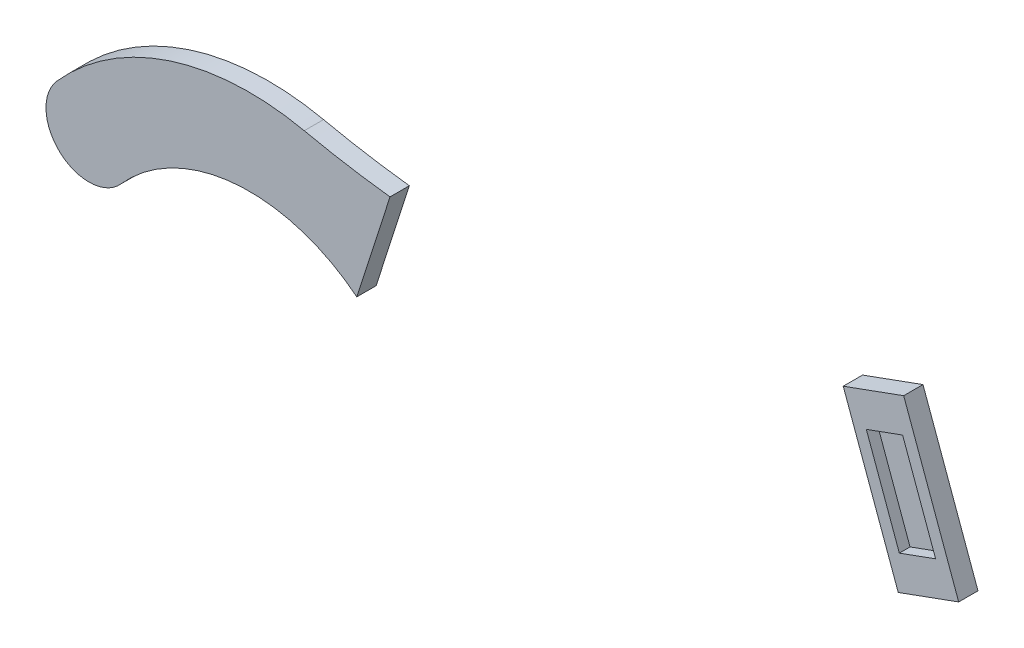
ISO-10303-21;
HEADER;
FILE_DESCRIPTION(('STEP AP214'),'2;1');
FILE_NAME('part.step','',(''),(''),'','','');
FILE_SCHEMA(('AUTOMOTIVE_DESIGN { 1 0 10303 214 1 1 1 1 }'));
ENDSEC;
DATA;
#1=APPLICATION_CONTEXT('core data for automotive mechanical design processes');
#2=APPLICATION_PROTOCOL_DEFINITION('international standard','automotive_design',2000,#1);
#3=PRODUCT_CONTEXT('',#1,'mechanical');
#4=PRODUCT('Part','Part','',(#3));
#5=PRODUCT_RELATED_PRODUCT_CATEGORY('part','',(#4));
#6=PRODUCT_DEFINITION_FORMATION('','',#4);
#7=PRODUCT_DEFINITION_CONTEXT('part definition',#1,'design');
#8=PRODUCT_DEFINITION('design','',#6,#7);
#9=PRODUCT_DEFINITION_SHAPE('','',#8);
#10=(LENGTH_UNIT() NAMED_UNIT(*) SI_UNIT(.MILLI.,.METRE.));
#11=(NAMED_UNIT(*) PLANE_ANGLE_UNIT() SI_UNIT($,.RADIAN.));
#12=(NAMED_UNIT(*) SI_UNIT($,.STERADIAN.) SOLID_ANGLE_UNIT());
#13=UNCERTAINTY_MEASURE_WITH_UNIT(LENGTH_MEASURE(1.E-05),#10,'distance_accuracy_value','');
#14=(GEOMETRIC_REPRESENTATION_CONTEXT(3) GLOBAL_UNCERTAINTY_ASSIGNED_CONTEXT((#13)) GLOBAL_UNIT_ASSIGNED_CONTEXT((#10,
#11,#12)) REPRESENTATION_CONTEXT('',''));
#15=CARTESIAN_POINT('',(0.,0.,0.));
#16=DIRECTION('',(0.,0.,1.));
#17=DIRECTION('',(1.,0.,0.));
#18=AXIS2_PLACEMENT_3D('',#15,#16,#17);
#19=CARTESIAN_POINT('',(-380.564455781356,753.21180889001,18.));
#20=DIRECTION('',(0.,0.,1.));
#21=DIRECTION('',(1.,0.,0.));
#22=AXIS2_PLACEMENT_3D('',#19,#20,#21);
#23=PLANE('',#22);
#24=DIRECTION('',(-0.306394816963695,-0.951904520494458,0.));
#25=VECTOR('',#24,1.);
#26=CARTESIAN_POINT('',(-457.092499604826,-10.7647385353538,18.));
#27=LINE('',#26,#25);
#28=CARTESIAN_POINT('',(-479.033464241387,-78.9307200246099,18.));
#29=VERTEX_POINT('',#28);
#30=CARTESIAN_POINT('',(-510.024758340126,-175.214179519483,18.));
#31=VERTEX_POINT('',#30);
#32=EDGE_CURVE('E12',#29,#31,#27,.T.);
#33=ORIENTED_EDGE('',*,*,#32,.F.);
#34=CARTESIAN_POINT('',(-380.564455781356,753.21180889001,18.));
#35=DIRECTION('',(0.,0.,-1.));
#36=DIRECTION('',(1.,0.,0.));
#37=AXIS2_PLACEMENT_3D('',#34,#35,#36);
#38=CIRCLE('',#37,837.948288413742);
#39=CARTESIAN_POINT('',(-559.0472163884,-65.5074581494367,18.));
#40=VERTEX_POINT('',#39);
#41=EDGE_CURVE('E100',#29,#40,#38,.T.);
#42=ORIENTED_EDGE('',*,*,#41,.T.);
#43=CARTESIAN_POINT('',(-610.167151995381,-300.,18.));
#44=DIRECTION('',(0.,0.,1.));
#45=DIRECTION('',(-1.,0.,0.));
#46=AXIS2_PLACEMENT_3D('',#43,#44,#45);
#47=CIRCLE('',#46,240.);
#48=CARTESIAN_POINT('',(-789.821657990136,-140.864025199264,18.));
#49=VERTEX_POINT('',#48);
#50=EDGE_CURVE('E97',#40,#49,#47,.T.);
#51=ORIENTED_EDGE('',*,*,#50,.T.);
#52=CARTESIAN_POINT('',(-759.879240324344,-167.386687666053,18.));
#53=DIRECTION('',(0.,0.,1.));
#54=DIRECTION('',(-1.,0.,0.));
#55=AXIS2_PLACEMENT_3D('',#52,#53,#54);
#56=CIRCLE('',#55,40.);
#57=CARTESIAN_POINT('',(-729.936822658551,-193.909350132843,18.));
#58=VERTEX_POINT('',#57);
#59=EDGE_CURVE('E117',#49,#58,#56,.T.);
#60=ORIENTED_EDGE('',*,*,#59,.T.);
#61=CARTESIAN_POINT('',(-610.167151995381,-300.,18.));
#62=DIRECTION('',(0.,0.,-1.));
#63=DIRECTION('',(1.,0.,0.));
#64=AXIS2_PLACEMENT_3D('',#61,#62,#63);
#65=CIRCLE('',#64,160.);
#66=EDGE_CURVE('E119',#58,#31,#65,.T.);
#67=ORIENTED_EDGE('',*,*,#66,.T.);
#68=EDGE_LOOP('',(#33,#42,#51,#60,#67));
#69=FACE_BOUND('',#68,.T.);
#70=ADVANCED_FACE('F47',(#69),#23,.T.);
#71=CARTESIAN_POINT('',(-380.564455781356,753.21180889001,0.));
#72=DIRECTION('',(0.,0.,1.));
#73=DIRECTION('',(1.,0.,0.));
#74=AXIS2_PLACEMENT_3D('',#71,#72,#73);
#75=PLANE('',#74);
#76=CARTESIAN_POINT('',(-380.564455781356,753.21180889001,0.));
#77=DIRECTION('',(0.,0.,-1.));
#78=DIRECTION('',(1.,0.,0.));
#79=AXIS2_PLACEMENT_3D('',#76,#77,#78);
#80=CIRCLE('',#79,837.948288413742);
#81=CARTESIAN_POINT('',(-479.033464241387,-78.9307200246099,0.));
#82=VERTEX_POINT('',#81);
#83=CARTESIAN_POINT('',(-559.0472163884,-65.5074581494367,0.));
#84=VERTEX_POINT('',#83);
#85=EDGE_CURVE('E109',#82,#84,#80,.T.);
#86=ORIENTED_EDGE('',*,*,#85,.F.);
#87=DIRECTION('',(-0.306394816963695,-0.951904520494458,0.));
#88=VECTOR('',#87,1.);
#89=CARTESIAN_POINT('',(-457.092499604826,-10.7647385353538,0.));
#90=LINE('',#89,#88);
#91=CARTESIAN_POINT('',(-510.024758340126,-175.214179519483,0.));
#92=VERTEX_POINT('',#91);
#93=EDGE_CURVE('E51',#82,#92,#90,.T.);
#94=ORIENTED_EDGE('',*,*,#93,.T.);
#95=CARTESIAN_POINT('',(-610.167151995381,-300.,0.));
#96=DIRECTION('',(0.,0.,-1.));
#97=DIRECTION('',(1.,0.,0.));
#98=AXIS2_PLACEMENT_3D('',#95,#96,#97);
#99=CIRCLE('',#98,160.);
#100=CARTESIAN_POINT('',(-729.936822658551,-193.909350132843,0.));
#101=VERTEX_POINT('',#100);
#102=EDGE_CURVE('E125',#101,#92,#99,.T.);
#103=ORIENTED_EDGE('',*,*,#102,.F.);
#104=CARTESIAN_POINT('',(-759.879240324344,-167.386687666053,0.));
#105=DIRECTION('',(0.,0.,1.));
#106=DIRECTION('',(-1.,0.,0.));
#107=AXIS2_PLACEMENT_3D('',#104,#105,#106);
#108=CIRCLE('',#107,40.);
#109=CARTESIAN_POINT('',(-789.821657990136,-140.864025199264,0.));
#110=VERTEX_POINT('',#109);
#111=EDGE_CURVE('E82',#110,#101,#108,.T.);
#112=ORIENTED_EDGE('',*,*,#111,.F.);
#113=CARTESIAN_POINT('',(-610.167151995381,-300.,0.));
#114=DIRECTION('',(0.,0.,1.));
#115=DIRECTION('',(-1.,0.,0.));
#116=AXIS2_PLACEMENT_3D('',#113,#114,#115);
#117=CIRCLE('',#116,240.);
#118=EDGE_CURVE('E112',#84,#110,#117,.T.);
#119=ORIENTED_EDGE('',*,*,#118,.F.);
#120=EDGE_LOOP('',(#86,#94,#103,#112,#119));
#121=FACE_BOUND('',#120,.T.);
#122=ADVANCED_FACE('F49',(#121),#75,.F.);
#123=CARTESIAN_POINT('',(-380.564455781356,753.21180889001,18.));
#124=DIRECTION('',(0.,0.,-1.));
#125=DIRECTION('',(-1.,0.,0.));
#126=AXIS2_PLACEMENT_3D('',#123,#124,#125);
#127=CYLINDRICAL_SURFACE('',#126,837.948288413742);
#128=ORIENTED_EDGE('',*,*,#41,.F.);
#129=DIRECTION('',(0.,0.,-1.));
#130=VECTOR('',#129,1.);
#131=CARTESIAN_POINT('',(-479.033464241387,-78.9307200246097,18.));
#132=LINE('',#131,#130);
#133=EDGE_CURVE('E62',#29,#82,#132,.T.);
#134=ORIENTED_EDGE('',*,*,#133,.T.);
#135=ORIENTED_EDGE('',*,*,#85,.T.);
#136=DIRECTION('',(0.,0.,-1.));
#137=VECTOR('',#136,1.);
#138=CARTESIAN_POINT('',(-559.0472163884,-65.5074581494367,18.));
#139=LINE('',#138,#137);
#140=EDGE_CURVE('E106',#40,#84,#139,.T.);
#141=ORIENTED_EDGE('',*,*,#140,.F.);
#142=EDGE_LOOP('',(#128,#134,#135,#141));
#143=FACE_BOUND('',#142,.T.);
#144=ADVANCED_FACE('F107',(#143),#127,.F.);
#145=CARTESIAN_POINT('',(-610.167151995381,-300.,18.));
#146=DIRECTION('',(0.,0.,-1.));
#147=DIRECTION('',(-1.,0.,0.));
#148=AXIS2_PLACEMENT_3D('',#145,#146,#147);
#149=CYLINDRICAL_SURFACE('',#148,240.);
#150=ORIENTED_EDGE('',*,*,#118,.T.);
#151=DIRECTION('',(0.,0.,-1.));
#152=VECTOR('',#151,1.);
#153=CARTESIAN_POINT('',(-789.821657990136,-140.864025199264,18.));
#154=LINE('',#153,#152);
#155=EDGE_CURVE('E115',#49,#110,#154,.T.);
#156=ORIENTED_EDGE('',*,*,#155,.F.);
#157=ORIENTED_EDGE('',*,*,#50,.F.);
#158=ORIENTED_EDGE('',*,*,#140,.T.);
#159=EDGE_LOOP('',(#150,#156,#157,#158));
#160=FACE_BOUND('',#159,.T.);
#161=ADVANCED_FACE('F114',(#160),#149,.T.);
#162=CARTESIAN_POINT('',(-759.879240324344,-167.386687666053,18.));
#163=DIRECTION('',(0.,0.,-1.));
#164=DIRECTION('',(-1.,0.,0.));
#165=AXIS2_PLACEMENT_3D('',#162,#163,#164);
#166=CYLINDRICAL_SURFACE('',#165,40.);
#167=ORIENTED_EDGE('',*,*,#111,.T.);
#168=DIRECTION('',(0.,0.,-1.));
#169=VECTOR('',#168,1.);
#170=CARTESIAN_POINT('',(-729.936822658551,-193.909350132843,18.));
#171=LINE('',#170,#169);
#172=EDGE_CURVE('E56',#58,#101,#171,.T.);
#173=ORIENTED_EDGE('',*,*,#172,.F.);
#174=ORIENTED_EDGE('',*,*,#59,.F.);
#175=ORIENTED_EDGE('',*,*,#155,.T.);
#176=EDGE_LOOP('',(#167,#173,#174,#175));
#177=FACE_BOUND('',#176,.T.);
#178=ADVANCED_FACE('F137',(#177),#166,.T.);
#179=CARTESIAN_POINT('',(-610.167151995381,-300.,18.));
#180=DIRECTION('',(0.,0.,-1.));
#181=DIRECTION('',(-1.,0.,0.));
#182=AXIS2_PLACEMENT_3D('',#179,#180,#181);
#183=CYLINDRICAL_SURFACE('',#182,160.);
#184=ORIENTED_EDGE('',*,*,#102,.T.);
#185=DIRECTION('',(0.,0.,-1.));
#186=VECTOR('',#185,1.);
#187=CARTESIAN_POINT('',(-510.024758340126,-175.214179519483,18.));
#188=LINE('',#187,#186);
#189=EDGE_CURVE('E124',#92,#31,#188,.F.);
#190=ORIENTED_EDGE('',*,*,#189,.T.);
#191=ORIENTED_EDGE('',*,*,#66,.F.);
#192=ORIENTED_EDGE('',*,*,#172,.T.);
#193=EDGE_LOOP('',(#184,#190,#191,#192));
#194=FACE_BOUND('',#193,.T.);
#195=ADVANCED_FACE('F138',(#194),#183,.F.);
#196=CARTESIAN_POINT('',(-457.092499604826,-10.7647385353538,0.));
#197=DIRECTION('',(-0.951904520494458,0.306394816963695,0.));
#198=DIRECTION('',(-0.306394816963695,-0.951904520494458,0.));
#199=AXIS2_PLACEMENT_3D('',#196,#197,#198);
#200=PLANE('',#199);
#201=ORIENTED_EDGE('',*,*,#32,.T.);
#202=ORIENTED_EDGE('',*,*,#189,.F.);
#203=ORIENTED_EDGE('',*,*,#93,.F.);
#204=ORIENTED_EDGE('',*,*,#133,.F.);
#205=EDGE_LOOP('',(#201,#202,#203,#204));
#206=FACE_BOUND('',#205,.T.);
#207=ADVANCED_FACE('F140',(#206),#200,.F.);
#208=CLOSED_SHELL('',(#70,#122,#144,#161,#178,#195,#207));
#209=MANIFOLD_SOLID_BREP('B2',#208);
#210=CARTESIAN_POINT('',(0.,0.,18.));
#211=DIRECTION('',(-0.939692620785909,-0.342020143325666,0.));
#212=DIRECTION('',(0.342020143325666,-0.93969262078591,0.));
#213=AXIS2_PLACEMENT_3D('',#210,#211,#212);
#214=PLANE('',#213);
#215=DIRECTION('',(-0.342020143325666,0.939692620785909,0.));
#216=VECTOR('',#215,1.);
#217=CARTESIAN_POINT('',(0.,0.,0.));
#218=LINE('',#217,#216);
#219=CARTESIAN_POINT('',(51.3030214988499,-140.953893117886,0.));
#220=VERTEX_POINT('',#219);
#221=CARTESIAN_POINT('',(0.,0.,0.));
#222=VERTEX_POINT('',#221);
#223=EDGE_CURVE('E335',#220,#222,#218,.T.);
#224=ORIENTED_EDGE('',*,*,#223,.T.);
#225=DIRECTION('',(0.,0.,-1.));
#226=VECTOR('',#225,1.);
#227=CARTESIAN_POINT('',(0.,0.,18.));
#228=LINE('',#227,#226);
#229=CARTESIAN_POINT('',(0.,0.,18.));
#230=VERTEX_POINT('',#229);
#231=EDGE_CURVE('E329',#230,#222,#228,.T.);
#232=ORIENTED_EDGE('',*,*,#231,.F.);
#233=DIRECTION('',(-0.342020143325666,0.939692620785909,0.));
#234=VECTOR('',#233,1.);
#235=CARTESIAN_POINT('',(0.,0.,18.));
#236=LINE('',#235,#234);
#237=CARTESIAN_POINT('',(51.3030214988499,-140.953893117886,18.));
#238=VERTEX_POINT('',#237);
#239=EDGE_CURVE('E323',#238,#230,#236,.T.);
#240=ORIENTED_EDGE('',*,*,#239,.F.);
#241=DIRECTION('',(0.,0.,-1.));
#242=VECTOR('',#241,1.);
#243=CARTESIAN_POINT('',(51.3030214988499,-140.953893117886,18.));
#244=LINE('',#243,#242);
#245=EDGE_CURVE('E206',#238,#220,#244,.T.);
#246=ORIENTED_EDGE('',*,*,#245,.T.);
#247=EDGE_LOOP('',(#224,#232,#240,#246));
#248=FACE_BOUND('',#247,.T.);
#249=ADVANCED_FACE('F198',(#248),#214,.F.);
#250=CARTESIAN_POINT('',(-380.564455781356,753.21180889001,18.));
#251=DIRECTION('',(0.,0.,1.));
#252=DIRECTION('',(1.,0.,0.));
#253=AXIS2_PLACEMENT_3D('',#250,#251,#252);
#254=PLANE('',#253);
#255=DIRECTION('',(-0.939692620785909,-0.342020143325666,0.));
#256=VECTOR('',#255,1.);
#257=CARTESIAN_POINT('',(-1.01570714966093,-32.2950203434853,18.));
#258=LINE('',#257,#256);
#259=CARTESIAN_POINT('',(-1.01570714966093,-32.2950203434853,18.));
#260=VERTEX_POINT('',#259);
#261=CARTESIAN_POINT('',(-34.8446414979536,-44.6077455032092,18.));
#262=VERTEX_POINT('',#261);
#263=EDGE_CURVE('E213',#260,#262,#258,.T.);
#264=ORIENTED_EDGE('',*,*,#263,.F.);
#265=DIRECTION('',(-0.342020143325666,0.939692620785909,0.));
#266=VECTOR('',#265,1.);
#267=CARTESIAN_POINT('',(-1.01570714966093,-32.2950203434853,18.));
#268=LINE('',#267,#266);
#269=CARTESIAN_POINT('',(29.766105749649,-116.867356214217,18.));
#270=VERTEX_POINT('',#269);
#271=EDGE_CURVE('E283',#270,#260,#268,.T.);
#272=ORIENTED_EDGE('',*,*,#271,.F.);
#273=DIRECTION('',(0.939692620785909,0.342020143325666,0.));
#274=VECTOR('',#273,1.);
#275=CARTESIAN_POINT('',(29.766105749649,-116.867356214217,18.));
#276=LINE('',#275,#274);
#277=CARTESIAN_POINT('',(-4.06282859864369,-129.180081373941,18.));
#278=VERTEX_POINT('',#277);
#279=EDGE_CURVE('E287',#278,#270,#276,.T.);
#280=ORIENTED_EDGE('',*,*,#279,.F.);
#281=DIRECTION('',(0.342020143325666,-0.939692620785909,0.));
#282=VECTOR('',#281,1.);
#283=CARTESIAN_POINT('',(-34.8446414979536,-44.6077455032092,18.));
#284=LINE('',#283,#282);
#285=EDGE_CURVE('E295',#262,#278,#284,.T.);
#286=ORIENTED_EDGE('',*,*,#285,.F.);
#287=EDGE_LOOP('',(#264,#272,#280,#286));
#288=FACE_BOUND('',#287,.T.);
#289=DIRECTION('',(-0.342020143325666,0.939692620785909,0.));
#290=VECTOR('',#289,1.);
#291=CARTESIAN_POINT('',(-5.07853574830464,-161.475101717426,18.));
#292=LINE('',#291,#290);
#293=CARTESIAN_POINT('',(-5.07853574830464,-161.475101717426,18.));
#294=VERTEX_POINT('',#293);
#295=CARTESIAN_POINT('',(-56.3815572471545,-20.5212085995401,18.));
#296=VERTEX_POINT('',#295);
#297=EDGE_CURVE('E307',#294,#296,#292,.T.);
#298=ORIENTED_EDGE('',*,*,#297,.F.);
#299=DIRECTION('',(0.939692620785909,0.342020143325666,0.));
#300=VECTOR('',#299,1.);
#301=CARTESIAN_POINT('',(51.3030214988499,-140.953893117886,18.));
#302=LINE('',#301,#300);
#303=EDGE_CURVE('E320',#294,#238,#302,.T.);
#304=ORIENTED_EDGE('',*,*,#303,.T.);
#305=ORIENTED_EDGE('',*,*,#239,.T.);
#306=DIRECTION('',(-0.939692620785909,-0.342020143325666,0.));
#307=VECTOR('',#306,1.);
#308=CARTESIAN_POINT('',(0.,0.,18.));
#309=LINE('',#308,#307);
#310=EDGE_CURVE('E324',#230,#296,#309,.T.);
#311=ORIENTED_EDGE('',*,*,#310,.T.);
#312=EDGE_LOOP('',(#298,#304,#305,#311));
#313=FACE_BOUND('',#312,.T.);
#314=ADVANCED_FACE('F364',(#288,#313),#254,.T.);
#315=CARTESIAN_POINT('',(-380.564455781356,753.21180889001,0.));
#316=DIRECTION('',(0.,0.,1.));
#317=DIRECTION('',(1.,0.,0.));
#318=AXIS2_PLACEMENT_3D('',#315,#316,#317);
#319=PLANE('',#318);
#320=DIRECTION('',(0.939692620785909,0.342020143325666,0.));
#321=VECTOR('',#320,1.);
#322=CARTESIAN_POINT('',(51.3030214988499,-140.953893117886,0.));
#323=LINE('',#322,#321);
#324=CARTESIAN_POINT('',(-5.07853574830464,-161.475101717426,0.));
#325=VERTEX_POINT('',#324);
#326=EDGE_CURVE('E333',#325,#220,#323,.T.);
#327=ORIENTED_EDGE('',*,*,#326,.F.);
#328=DIRECTION('',(-0.342020143325666,0.939692620785909,0.));
#329=VECTOR('',#328,1.);
#330=CARTESIAN_POINT('',(-5.07853574830464,-161.475101717426,0.));
#331=LINE('',#330,#329);
#332=CARTESIAN_POINT('',(-56.3815572471545,-20.52120859954,0.));
#333=VERTEX_POINT('',#332);
#334=EDGE_CURVE('E311',#325,#333,#331,.T.);
#335=ORIENTED_EDGE('',*,*,#334,.T.);
#336=DIRECTION('',(-0.939692620785909,-0.342020143325666,0.));
#337=VECTOR('',#336,1.);
#338=CARTESIAN_POINT('',(0.,0.,0.));
#339=LINE('',#338,#337);
#340=EDGE_CURVE('E330',#222,#333,#339,.T.);
#341=ORIENTED_EDGE('',*,*,#340,.F.);
#342=ORIENTED_EDGE('',*,*,#223,.F.);
#343=EDGE_LOOP('',(#327,#335,#341,#342));
#344=FACE_BOUND('',#343,.T.);
#345=ADVANCED_FACE('F349',(#344),#319,.F.);
#346=CARTESIAN_POINT('',(51.3030214988499,-140.953893117886,18.));
#347=DIRECTION('',(-0.342020143325666,0.939692620785909,0.));
#348=DIRECTION('',(-0.939692620785909,-0.342020143325666,0.));
#349=AXIS2_PLACEMENT_3D('',#346,#347,#348);
#350=PLANE('',#349);
#351=ORIENTED_EDGE('',*,*,#326,.T.);
#352=ORIENTED_EDGE('',*,*,#245,.F.);
#353=ORIENTED_EDGE('',*,*,#303,.F.);
#354=DIRECTION('',(0.,0.,-1.));
#355=VECTOR('',#354,1.);
#356=CARTESIAN_POINT('',(-5.07853574830464,-161.475101717426,18.));
#357=LINE('',#356,#355);
#358=EDGE_CURVE('E45',#294,#325,#357,.T.);
#359=ORIENTED_EDGE('',*,*,#358,.T.);
#360=EDGE_LOOP('',(#351,#352,#353,#359));
#361=FACE_BOUND('',#360,.T.);
#362=ADVANCED_FACE('F385',(#361),#350,.F.);
#363=CARTESIAN_POINT('',(0.,0.,18.));
#364=DIRECTION('',(0.342020143325666,-0.939692620785909,0.));
#365=DIRECTION('',(0.93969262078591,0.342020143325666,0.));
#366=AXIS2_PLACEMENT_3D('',#363,#364,#365);
#367=PLANE('',#366);
#368=ORIENTED_EDGE('',*,*,#340,.T.);
#369=DIRECTION('',(0.,0.,1.));
#370=VECTOR('',#369,1.);
#371=CARTESIAN_POINT('',(-56.3815572471546,-20.52120859954,18.));
#372=LINE('',#371,#370);
#373=EDGE_CURVE('E221',#333,#296,#372,.T.);
#374=ORIENTED_EDGE('',*,*,#373,.T.);
#375=ORIENTED_EDGE('',*,*,#310,.F.);
#376=ORIENTED_EDGE('',*,*,#231,.T.);
#377=EDGE_LOOP('',(#368,#374,#375,#376));
#378=FACE_BOUND('',#377,.T.);
#379=ADVANCED_FACE('F200',(#378),#367,.F.);
#380=CARTESIAN_POINT('',(-5.07853574830464,-161.475101717426,0.));
#381=DIRECTION('',(0.939692620785909,0.342020143325666,0.));
#382=DIRECTION('',(-0.342020143325666,0.939692620785909,0.));
#383=AXIS2_PLACEMENT_3D('',#380,#381,#382);
#384=PLANE('',#383);
#385=ORIENTED_EDGE('',*,*,#334,.F.);
#386=ORIENTED_EDGE('',*,*,#358,.F.);
#387=ORIENTED_EDGE('',*,*,#297,.T.);
#388=ORIENTED_EDGE('',*,*,#373,.F.);
#389=EDGE_LOOP('',(#385,#386,#387,#388));
#390=FACE_BOUND('',#389,.T.);
#391=ADVANCED_FACE('F374',(#390),#384,.F.);
#392=CARTESIAN_POINT('',(-1.01570714966093,-32.2950203434853,8.));
#393=DIRECTION('',(-0.342020143325666,0.939692620785909,0.));
#394=DIRECTION('',(-0.939692620785909,-0.342020143325666,0.));
#395=AXIS2_PLACEMENT_3D('',#392,#393,#394);
#396=PLANE('',#395);
#397=ORIENTED_EDGE('',*,*,#263,.T.);
#398=DIRECTION('',(0.,0.,1.));
#399=VECTOR('',#398,1.);
#400=CARTESIAN_POINT('',(-34.8446414979536,-44.6077455032092,8.));
#401=LINE('',#400,#399);
#402=CARTESIAN_POINT('',(-34.8446414979536,-44.6077455032092,8.));
#403=VERTEX_POINT('',#402);
#404=EDGE_CURVE('E261',#403,#262,#401,.T.);
#405=ORIENTED_EDGE('',*,*,#404,.F.);
#406=DIRECTION('',(-0.939692620785909,-0.342020143325666,0.));
#407=VECTOR('',#406,1.);
#408=CARTESIAN_POINT('',(-1.01570714966093,-32.2950203434853,8.));
#409=LINE('',#408,#407);
#410=CARTESIAN_POINT('',(-1.01570714966093,-32.2950203434853,8.));
#411=VERTEX_POINT('',#410);
#412=EDGE_CURVE('E265',#411,#403,#409,.T.);
#413=ORIENTED_EDGE('',*,*,#412,.F.);
#414=DIRECTION('',(0.,0.,1.));
#415=VECTOR('',#414,1.);
#416=CARTESIAN_POINT('',(-1.01570714966093,-32.2950203434853,8.));
#417=LINE('',#416,#415);
#418=EDGE_CURVE('E305',#411,#260,#417,.T.);
#419=ORIENTED_EDGE('',*,*,#418,.T.);
#420=EDGE_LOOP('',(#397,#405,#413,#419));
#421=FACE_BOUND('',#420,.T.);
#422=ADVANCED_FACE('F263',(#421),#396,.F.);
#423=CARTESIAN_POINT('',(-1.01570714966093,-32.2950203434853,8.));
#424=DIRECTION('',(0.939692620785909,0.342020143325666,0.));
#425=DIRECTION('',(-0.342020143325666,0.939692620785909,0.));
#426=AXIS2_PLACEMENT_3D('',#423,#424,#425);
#427=PLANE('',#426);
#428=ORIENTED_EDGE('',*,*,#271,.T.);
#429=ORIENTED_EDGE('',*,*,#418,.F.);
#430=DIRECTION('',(-0.342020143325666,0.939692620785909,0.));
#431=VECTOR('',#430,1.);
#432=CARTESIAN_POINT('',(-1.01570714966093,-32.2950203434853,8.));
#433=LINE('',#432,#431);
#434=CARTESIAN_POINT('',(29.766105749649,-116.867356214217,8.));
#435=VERTEX_POINT('',#434);
#436=EDGE_CURVE('E271',#435,#411,#433,.T.);
#437=ORIENTED_EDGE('',*,*,#436,.F.);
#438=DIRECTION('',(0.,0.,1.));
#439=VECTOR('',#438,1.);
#440=CARTESIAN_POINT('',(29.766105749649,-116.867356214217,8.));
#441=LINE('',#440,#439);
#442=EDGE_CURVE('E308',#435,#270,#441,.T.);
#443=ORIENTED_EDGE('',*,*,#442,.T.);
#444=EDGE_LOOP('',(#428,#429,#437,#443));
#445=FACE_BOUND('',#444,.T.);
#446=ADVANCED_FACE('F366',(#445),#427,.F.);
#447=CARTESIAN_POINT('',(29.766105749649,-116.867356214217,8.));
#448=DIRECTION('',(0.342020143325666,-0.939692620785909,0.));
#449=DIRECTION('',(0.939692620785909,0.342020143325666,0.));
#450=AXIS2_PLACEMENT_3D('',#447,#448,#449);
#451=PLANE('',#450);
#452=ORIENTED_EDGE('',*,*,#279,.T.);
#453=ORIENTED_EDGE('',*,*,#442,.F.);
#454=DIRECTION('',(0.939692620785909,0.342020143325666,0.));
#455=VECTOR('',#454,1.);
#456=CARTESIAN_POINT('',(29.766105749649,-116.867356214217,8.));
#457=LINE('',#456,#455);
#458=CARTESIAN_POINT('',(-4.06282859864369,-129.180081373941,8.));
#459=VERTEX_POINT('',#458);
#460=EDGE_CURVE('E279',#459,#435,#457,.T.);
#461=ORIENTED_EDGE('',*,*,#460,.F.);
#462=DIRECTION('',(0.,0.,1.));
#463=VECTOR('',#462,1.);
#464=CARTESIAN_POINT('',(-4.06282859864369,-129.180081373941,8.));
#465=LINE('',#464,#463);
#466=EDGE_CURVE('E270',#459,#278,#465,.T.);
#467=ORIENTED_EDGE('',*,*,#466,.T.);
#468=EDGE_LOOP('',(#452,#453,#461,#467));
#469=FACE_BOUND('',#468,.T.);
#470=ADVANCED_FACE('F362',(#469),#451,.F.);
#471=CARTESIAN_POINT('',(-34.8446414979536,-44.6077455032092,8.));
#472=DIRECTION('',(-0.939692620785909,-0.342020143325666,0.));
#473=DIRECTION('',(0.342020143325666,-0.939692620785909,0.));
#474=AXIS2_PLACEMENT_3D('',#471,#472,#473);
#475=PLANE('',#474);
#476=ORIENTED_EDGE('',*,*,#285,.T.);
#477=ORIENTED_EDGE('',*,*,#466,.F.);
#478=DIRECTION('',(0.342020143325666,-0.939692620785909,0.));
#479=VECTOR('',#478,1.);
#480=CARTESIAN_POINT('',(-34.8446414979536,-44.6077455032092,8.));
#481=LINE('',#480,#479);
#482=EDGE_CURVE('E274',#403,#459,#481,.T.);
#483=ORIENTED_EDGE('',*,*,#482,.F.);
#484=ORIENTED_EDGE('',*,*,#404,.T.);
#485=EDGE_LOOP('',(#476,#477,#483,#484));
#486=FACE_BOUND('',#485,.T.);
#487=ADVANCED_FACE('F275',(#486),#475,.F.);
#488=CARTESIAN_POINT('',(0.,0.,8.));
#489=DIRECTION('',(0.,0.,1.));
#490=DIRECTION('',(1.,0.,0.));
#491=AXIS2_PLACEMENT_3D('',#488,#489,#490);
#492=PLANE('',#491);
#493=ORIENTED_EDGE('',*,*,#412,.T.);
#494=ORIENTED_EDGE('',*,*,#482,.T.);
#495=ORIENTED_EDGE('',*,*,#460,.T.);
#496=ORIENTED_EDGE('',*,*,#436,.T.);
#497=EDGE_LOOP('',(#493,#494,#495,#496));
#498=FACE_BOUND('',#497,.T.);
#499=ADVANCED_FACE('F281',(#498),#492,.T.);
#500=CLOSED_SHELL('',(#249,#314,#345,#362,#379,#391,#422,#446,#470,#487,#499));
#501=MANIFOLD_SOLID_BREP('B6',#500);
#502=ADVANCED_BREP_SHAPE_REPRESENTATION('',(#18,#209,#501),#14);
#503=SHAPE_DEFINITION_REPRESENTATION(#9,#502);
ENDSEC;
END-ISO-10303-21;
